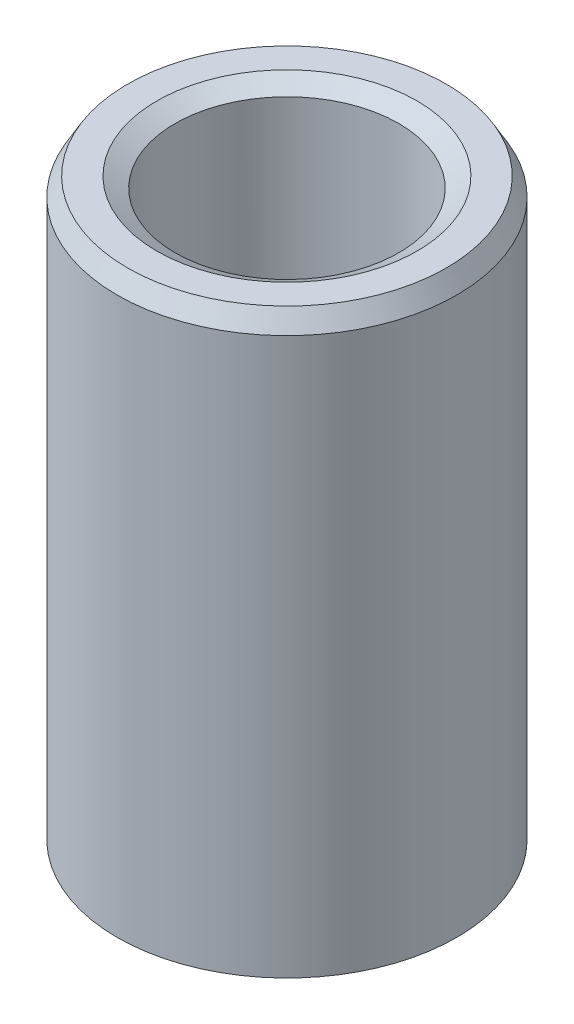
ISO-10303-21;
HEADER;
FILE_DESCRIPTION(('STEP AP214'),'2;1');
FILE_NAME('part.step','',(''),(''),'','','');
FILE_SCHEMA(('AUTOMOTIVE_DESIGN { 1 0 10303 214 1 1 1 1 }'));
ENDSEC;
DATA;
#1=APPLICATION_CONTEXT('core data for automotive mechanical design processes');
#2=APPLICATION_PROTOCOL_DEFINITION('international standard','automotive_design',2000,#1);
#3=PRODUCT_CONTEXT('',#1,'mechanical');
#4=PRODUCT('Part','Part','',(#3));
#5=PRODUCT_RELATED_PRODUCT_CATEGORY('part','',(#4));
#6=PRODUCT_DEFINITION_FORMATION('','',#4);
#7=PRODUCT_DEFINITION_CONTEXT('part definition',#1,'design');
#8=PRODUCT_DEFINITION('design','',#6,#7);
#9=PRODUCT_DEFINITION_SHAPE('','',#8);
#10=(LENGTH_UNIT() NAMED_UNIT(*) SI_UNIT(.MILLI.,.METRE.));
#11=(NAMED_UNIT(*) PLANE_ANGLE_UNIT() SI_UNIT($,.RADIAN.));
#12=(NAMED_UNIT(*) SI_UNIT($,.STERADIAN.) SOLID_ANGLE_UNIT());
#13=UNCERTAINTY_MEASURE_WITH_UNIT(LENGTH_MEASURE(1.E-05),#10,'distance_accuracy_value','');
#14=(GEOMETRIC_REPRESENTATION_CONTEXT(3) GLOBAL_UNCERTAINTY_ASSIGNED_CONTEXT((#13)) GLOBAL_UNIT_ASSIGNED_CONTEXT((#10,
#11,#12)) REPRESENTATION_CONTEXT('',''));
#15=CARTESIAN_POINT('',(0.,0.,0.));
#16=DIRECTION('',(0.,0.,1.));
#17=DIRECTION('',(1.,0.,0.));
#18=AXIS2_PLACEMENT_3D('',#15,#16,#17);
#19=CARTESIAN_POINT('',(0.,86.1242029296773,0.));
#20=DIRECTION('',(0.,-1.,0.));
#21=DIRECTION('',(0.,0.,-1.));
#22=AXIS2_PLACEMENT_3D('',#19,#20,#21);
#23=CYLINDRICAL_SURFACE('',#22,25.);
#24=CARTESIAN_POINT('',(0.,1.54522787854962,0.));
#25=DIRECTION('',(0.,1.,0.));
#26=DIRECTION('',(0.,0.,1.));
#27=AXIS2_PLACEMENT_3D('',#24,#25,#26);
#28=CIRCLE('',#27,25.);
#29=CARTESIAN_POINT('',(0.,1.54522787854962,25.));
#30=VERTEX_POINT('',#29);
#31=EDGE_CURVE('E10',#30,#30,#28,.T.);
#32=ORIENTED_EDGE('',*,*,#31,.T.);
#33=EDGE_LOOP('',(#32));
#34=FACE_BOUND('',#33,.T.);
#35=CARTESIAN_POINT('',(0.,83.4477897347575,0.));
#36=DIRECTION('',(0.,1.,0.));
#37=DIRECTION('',(0.,0.,1.));
#38=AXIS2_PLACEMENT_3D('',#35,#36,#37);
#39=CIRCLE('',#38,25.);
#40=CARTESIAN_POINT('',(0.,83.4477897347575,25.));
#41=VERTEX_POINT('',#40);
#42=EDGE_CURVE('E50',#41,#41,#39,.F.);
#43=ORIENTED_EDGE('',*,*,#42,.T.);
#44=EDGE_LOOP('',(#43));
#45=FACE_BOUND('',#44,.T.);
#46=ADVANCED_FACE('F39',(#34,#45),#23,.T.);
#47=CARTESIAN_POINT('',(0.,86.1242029296773,0.));
#48=DIRECTION('',(0.,1.,0.));
#49=DIRECTION('',(0.,0.,1.));
#50=AXIS2_PLACEMENT_3D('',#47,#48,#49);
#51=PLANE('',#50);
#52=CARTESIAN_POINT('',(0.,86.1242029296773,0.));
#53=DIRECTION('',(0.,1.,0.));
#54=DIRECTION('',(0.,0.,1.));
#55=AXIS2_PLACEMENT_3D('',#52,#53,#54);
#56=CIRCLE('',#55,19.1548097208004);
#57=CARTESIAN_POINT('',(0.,86.1242029296773,19.1548097208004));
#58=VERTEX_POINT('',#57);
#59=EDGE_CURVE('E58',#58,#58,#56,.F.);
#60=ORIENTED_EDGE('',*,*,#59,.T.);
#61=EDGE_LOOP('',(#60));
#62=FACE_BOUND('',#61,.T.);
#63=CARTESIAN_POINT('',(0.,86.1242029296773,0.));
#64=DIRECTION('',(0.,1.,0.));
#65=DIRECTION('',(0.,0.,1.));
#66=AXIS2_PLACEMENT_3D('',#63,#64,#65);
#67=CIRCLE('',#66,23.4547721214504);
#68=CARTESIAN_POINT('',(0.,86.1242029296773,23.4547721214504));
#69=VERTEX_POINT('',#68);
#70=EDGE_CURVE('E61',#69,#69,#67,.T.);
#71=ORIENTED_EDGE('',*,*,#70,.T.);
#72=EDGE_LOOP('',(#71));
#73=FACE_BOUND('',#72,.T.);
#74=ADVANCED_FACE('F88',(#62,#73),#51,.T.);
#75=CARTESIAN_POINT('',(0.,0.,0.));
#76=DIRECTION('',(0.,1.,0.));
#77=DIRECTION('',(0.,0.,1.));
#78=AXIS2_PLACEMENT_3D('',#75,#76,#77);
#79=PLANE('',#78);
#80=CARTESIAN_POINT('',(0.,0.,0.));
#81=DIRECTION('',(0.,1.,0.));
#82=DIRECTION('',(0.,0.,1.));
#83=AXIS2_PLACEMENT_3D('',#80,#81,#82);
#84=CIRCLE('',#83,18.0236244044302);
#85=CARTESIAN_POINT('',(0.,0.,-18.0236244044302));
#86=VERTEX_POINT('',#85);
#87=EDGE_CURVE('E51',#86,#86,#84,.T.);
#88=ORIENTED_EDGE('',*,*,#87,.T.);
#89=EDGE_LOOP('',(#88));
#90=FACE_BOUND('',#89,.T.);
#91=CARTESIAN_POINT('',(0.,0.,0.));
#92=DIRECTION('',(0.,1.,0.));
#93=DIRECTION('',(0.,0.,1.));
#94=AXIS2_PLACEMENT_3D('',#91,#92,#93);
#95=CIRCLE('',#94,22.3235868050802);
#96=CARTESIAN_POINT('',(0.,0.,22.3235868050802));
#97=VERTEX_POINT('',#96);
#98=EDGE_CURVE('E54',#97,#97,#95,.F.);
#99=ORIENTED_EDGE('',*,*,#98,.T.);
#100=EDGE_LOOP('',(#99));
#101=FACE_BOUND('',#100,.T.);
#102=ADVANCED_FACE('F83',(#90,#101),#79,.F.);
#103=CARTESIAN_POINT('',(0.,86.1242029296773,0.));
#104=DIRECTION('',(0.,-1.,0.));
#105=DIRECTION('',(0.,0.,-1.));
#106=AXIS2_PLACEMENT_3D('',#103,#104,#105);
#107=CYLINDRICAL_SURFACE('',#106,16.4783965258806);
#108=CARTESIAN_POINT('',(0.,84.5789750511277,0.));
#109=DIRECTION('',(0.,1.,0.));
#110=DIRECTION('',(0.,0.,1.));
#111=AXIS2_PLACEMENT_3D('',#108,#109,#110);
#112=CIRCLE('',#111,16.4783965258806);
#113=CARTESIAN_POINT('',(0.,84.5789750511277,16.4783965258806));
#114=VERTEX_POINT('',#113);
#115=EDGE_CURVE('E67',#114,#114,#112,.T.);
#116=ORIENTED_EDGE('',*,*,#115,.T.);
#117=EDGE_LOOP('',(#116));
#118=FACE_BOUND('',#117,.T.);
#119=CARTESIAN_POINT('',(0.,2.67641319491982,0.));
#120=DIRECTION('',(0.,1.,0.));
#121=DIRECTION('',(0.,0.,1.));
#122=AXIS2_PLACEMENT_3D('',#119,#120,#121);
#123=CIRCLE('',#122,16.4783965258806);
#124=CARTESIAN_POINT('',(0.,2.67641319491982,-16.4783965258806));
#125=VERTEX_POINT('',#124);
#126=EDGE_CURVE('E69',#125,#125,#123,.F.);
#127=ORIENTED_EDGE('',*,*,#126,.T.);
#128=EDGE_LOOP('',(#127));
#129=FACE_BOUND('',#128,.T.);
#130=ADVANCED_FACE('F71',(#118,#129),#107,.F.);
#131=CARTESIAN_POINT('',(0.,84.5789750511277,0.));
#132=DIRECTION('',(0.,1.,0.));
#133=DIRECTION('',(0.,0.,1.));
#134=AXIS2_PLACEMENT_3D('',#131,#132,#133);
#135=CONICAL_SURFACE('',#134,16.4783965258806,1.0471975511966);
#136=ORIENTED_EDGE('',*,*,#59,.F.);
#137=EDGE_LOOP('',(#136));
#138=FACE_BOUND('',#137,.T.);
#139=ORIENTED_EDGE('',*,*,#115,.F.);
#140=EDGE_LOOP('',(#139));
#141=FACE_BOUND('',#140,.T.);
#142=ADVANCED_FACE('F77',(#138,#141),#135,.F.);
#143=CARTESIAN_POINT('',(0.,0.,0.));
#144=DIRECTION('',(0.,-1.,0.));
#145=DIRECTION('',(0.,0.,-1.));
#146=AXIS2_PLACEMENT_3D('',#143,#144,#145);
#147=CONICAL_SURFACE('',#146,18.0236244044302,0.523598775598296);
#148=CARTESIAN_POINT('',(0.,2.67641319491982,-16.4783965258806));
#149=CARTESIAN_POINT('',(0.,2.64853389080607,-16.4944926496154));
#150=CARTESIAN_POINT('',(0.,2.62065458669232,-16.5105887733503));
#151=CARTESIAN_POINT('',(0.,2.56489597846483,-16.5427810208201));
#152=CARTESIAN_POINT('',(0.,2.53701667435108,-16.558877144555));
#153=CARTESIAN_POINT('',(0.,2.48125806612358,-16.5910693920248));
#154=CARTESIAN_POINT('',(0.,2.45337876200983,-16.6071655157597));
#155=CARTESIAN_POINT('',(0.,2.39762015378234,-16.6393577632295));
#156=CARTESIAN_POINT('',(0.,2.36974084966859,-16.6554538869644));
#157=CARTESIAN_POINT('',(0.,2.31398224144109,-16.6876461344342));
#158=CARTESIAN_POINT('',(0.,2.28610293732734,-16.703742258169));
#159=CARTESIAN_POINT('',(0.,2.23034432909985,-16.7359345056388));
#160=CARTESIAN_POINT('',(0.,2.2024650249861,-16.7520306293737));
#161=CARTESIAN_POINT('',(0.,2.1467064167586,-16.7842228768435));
#162=CARTESIAN_POINT('',(0.,2.11882711264486,-16.8003190005784));
#163=CARTESIAN_POINT('',(0.,2.06306850441736,-16.8325112480482));
#164=CARTESIAN_POINT('',(0.,2.03518920030361,-16.8486073717831));
#165=CARTESIAN_POINT('',(0.,1.97943059207612,-16.8807996192529));
#166=CARTESIAN_POINT('',(0.,1.95155128796237,-16.8968957429877));
#167=CARTESIAN_POINT('',(0.,1.89579267973487,-16.9290879904575));
#168=CARTESIAN_POINT('',(0.,1.86791337562112,-16.9451841141924));
#169=CARTESIAN_POINT('',(0.,1.81215476739363,-16.9773763616622));
#170=CARTESIAN_POINT('',(0.,1.78427546327988,-16.9934724853971));
#171=CARTESIAN_POINT('',(0.,1.72851685505238,-17.0256647328669));
#172=CARTESIAN_POINT('',(0.,1.70063755093863,-17.0417608566018));
#173=CARTESIAN_POINT('',(0.,1.64487894271114,-17.0739531040716));
#174=CARTESIAN_POINT('',(0.,1.61699963859739,-17.0900492278064));
#175=CARTESIAN_POINT('',(0.,1.56124103036989,-17.1222414752762));
#176=CARTESIAN_POINT('',(0.,1.53336172625615,-17.1383375990111));
#177=CARTESIAN_POINT('',(0.,1.47760311802865,-17.1705298464809));
#178=CARTESIAN_POINT('',(0.,1.4497238139149,-17.1866259702158));
#179=CARTESIAN_POINT('',(0.,1.39396520568741,-17.2188182176856));
#180=CARTESIAN_POINT('',(0.,1.36608590157366,-17.2349143414205));
#181=CARTESIAN_POINT('',(0.,1.31032729334616,-17.2671065888903));
#182=CARTESIAN_POINT('',(0.,1.28244798923241,-17.2832027126251));
#183=CARTESIAN_POINT('',(0.,1.22668938100492,-17.3153949600949));
#184=CARTESIAN_POINT('',(0.,1.19881007689117,-17.3314910838298));
#185=CARTESIAN_POINT('',(0.,1.14305146866367,-17.3636833312996));
#186=CARTESIAN_POINT('',(0.,1.11517216454992,-17.3797794550345));
#187=CARTESIAN_POINT('',(0.,1.05941355632243,-17.4119717025043));
#188=CARTESIAN_POINT('',(0.,1.03153425220868,-17.4280678262392));
#189=CARTESIAN_POINT('',(0.,0.975775643981184,-17.460260073709));
#190=CARTESIAN_POINT('',(0.,0.947896339867436,-17.4763561974439));
#191=CARTESIAN_POINT('',(0.,0.892137731639939,-17.5085484449136));
#192=CARTESIAN_POINT('',(0.,0.864258427526191,-17.5246445686485));
#193=CARTESIAN_POINT('',(0.,0.808499819298695,-17.5568368161183));
#194=CARTESIAN_POINT('',(0.,0.780620515184947,-17.5729329398532));
#195=CARTESIAN_POINT('',(0.,0.724861906957451,-17.605125187323));
#196=CARTESIAN_POINT('',(0.,0.696982602843703,-17.6212213110579));
#197=CARTESIAN_POINT('',(0.,0.641223994616206,-17.6534135585277));
#198=CARTESIAN_POINT('',(0.,0.613344690502459,-17.6695096822626));
#199=CARTESIAN_POINT('',(0.,0.557586082274962,-17.7017019297323));
#200=CARTESIAN_POINT('',(0.,0.529706778161214,-17.7177980534672));
#201=CARTESIAN_POINT('',(0.,0.473948169933718,-17.749990300937));
#202=CARTESIAN_POINT('',(0.,0.44606886581997,-17.7660864246719));
#203=CARTESIAN_POINT('',(0.,0.390310257592474,-17.7982786721417));
#204=CARTESIAN_POINT('',(0.,0.362430953478726,-17.8143747958766));
#205=CARTESIAN_POINT('',(0.,0.306672345251229,-17.8465670433464));
#206=CARTESIAN_POINT('',(0.,0.278793041137481,-17.8626631670813));
#207=CARTESIAN_POINT('',(0.,0.223034432909985,-17.894855414551));
#208=CARTESIAN_POINT('',(0.,0.195155128796237,-17.9109515382859));
#209=CARTESIAN_POINT('',(0.,0.139396520568741,-17.9431437857557));
#210=CARTESIAN_POINT('',(0.,0.111517216454992,-17.9592399094906));
#211=CARTESIAN_POINT('',(0.,0.0557586082274962,-17.9914321569604));
#212=CARTESIAN_POINT('',(0.,0.0278793041137482,-18.0075282806953));
#213=CARTESIAN_POINT('',(0.,0.,-18.0236244044302));
#214=B_SPLINE_CURVE_WITH_KNOTS('',3,(#148,#149,#150,#151,#152,#153,#154,#155,#156,#157,#158,
#159,#160,#161,#162,#163,#164,#165,#166,#167,#168,#169,#170,#171,#172,#173,#174,#175,#176,#177,
#178,#179,#180,#181,#182,#183,#184,#185,#186,#187,#188,#189,#190,#191,#192,#193,#194,#195,#196,
#197,#198,#199,#200,#201,#202,#203,#204,#205,#206,#207,#208,#209,#210,#211,#212,#213),
.UNSPECIFIED.,.F.,.F.,(4,2,2,2,2,2,2,2,2,2,2,2,2,2,2,2,2,2,2,2,2,2,2,2,2,2,2,2,2,2,2,2,4),(0.,
0.0965767424093512,0.193153484818702,0.289730227228054,0.386306969637405,0.482883712046756,
0.579460454456109,0.67603719686546,0.772613939274811,0.869190681684162,0.965767424093513,
1.06234416650286,1.15892090891222,1.25549765132157,1.35207439373092,1.44865113614027,
1.54522787854962,1.64180462095897,1.73838136336832,1.83495810577768,1.93153484818703,
2.02811159059638,2.12468833300573,2.22126507541508,2.31784181782443,2.41441856023378,
2.51099530264313,2.60757204505249,2.70414878746184,2.80072552987119,2.89730227228054,
2.99387901468989,3.09045575709924),.UNSPECIFIED.);
#215=EDGE_CURVE('BSEAM73',#125,#86,#214,.T.);
#216=ORIENTED_EDGE('',*,*,#126,.F.);
#217=ORIENTED_EDGE('',*,*,#87,.F.);
#218=ORIENTED_EDGE('',*,*,#215,.T.);
#219=ORIENTED_EDGE('',*,*,#215,.F.);
#220=EDGE_LOOP('',(#216,#218,#217,#219));
#221=FACE_BOUND('',#220,.T.);
#222=ADVANCED_FACE('F73',(#221),#147,.F.);
#223=CARTESIAN_POINT('',(0.,1.54522787854962,0.));
#224=DIRECTION('',(0.,1.,0.));
#225=DIRECTION('',(0.,0.,1.));
#226=AXIS2_PLACEMENT_3D('',#223,#224,#225);
#227=CONICAL_SURFACE('',#226,25.,1.0471975511966);
#228=ORIENTED_EDGE('',*,*,#98,.F.);
#229=EDGE_LOOP('',(#228));
#230=FACE_BOUND('',#229,.T.);
#231=ORIENTED_EDGE('',*,*,#31,.F.);
#232=EDGE_LOOP('',(#231));
#233=FACE_BOUND('',#232,.T.);
#234=ADVANCED_FACE('F76',(#230,#233),#227,.T.);
#235=CARTESIAN_POINT('',(0.,86.1242029296773,0.));
#236=DIRECTION('',(0.,-1.,0.));
#237=DIRECTION('',(0.,0.,-1.));
#238=AXIS2_PLACEMENT_3D('',#235,#236,#237);
#239=CONICAL_SURFACE('',#238,23.4547721214504,0.523598775598296);
#240=ORIENTED_EDGE('',*,*,#42,.F.);
#241=EDGE_LOOP('',(#240));
#242=FACE_BOUND('',#241,.T.);
#243=ORIENTED_EDGE('',*,*,#70,.F.);
#244=EDGE_LOOP('',(#243));
#245=FACE_BOUND('',#244,.T.);
#246=ADVANCED_FACE('F45',(#242,#245),#239,.T.);
#247=CLOSED_SHELL('',(#46,#74,#102,#130,#142,#222,#234,#246));
#248=MANIFOLD_SOLID_BREP('B2',#247);
#249=ADVANCED_BREP_SHAPE_REPRESENTATION('',(#18,#248),#14);
#250=SHAPE_DEFINITION_REPRESENTATION(#9,#249);
ENDSEC;
END-ISO-10303-21;
